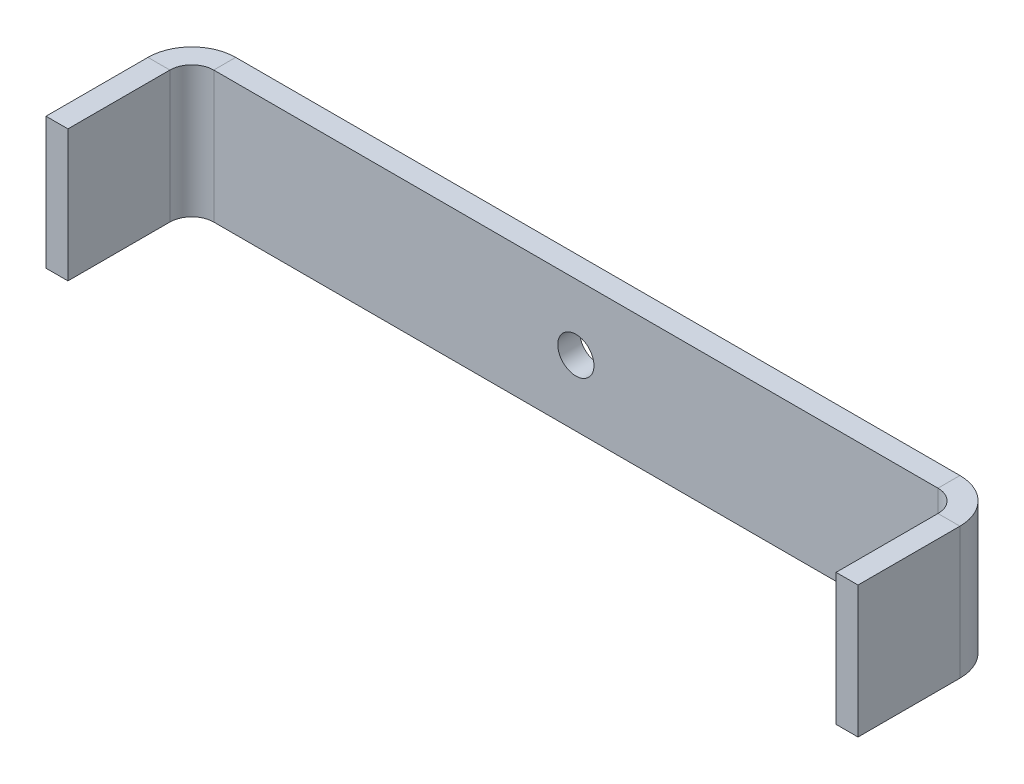
ISO-10303-21;
HEADER;
FILE_DESCRIPTION(('STEP AP214'),'2;1');
FILE_NAME('part.step','',(''),(''),'','','');
FILE_SCHEMA(('AUTOMOTIVE_DESIGN { 1 0 10303 214 1 1 1 1 }'));
ENDSEC;
DATA;
#1=APPLICATION_CONTEXT('core data for automotive mechanical design processes');
#2=APPLICATION_PROTOCOL_DEFINITION('international standard','automotive_design',2000,#1);
#3=PRODUCT_CONTEXT('',#1,'mechanical');
#4=PRODUCT('Part','Part','',(#3));
#5=PRODUCT_RELATED_PRODUCT_CATEGORY('part','',(#4));
#6=PRODUCT_DEFINITION_FORMATION('','',#4);
#7=PRODUCT_DEFINITION_CONTEXT('part definition',#1,'design');
#8=PRODUCT_DEFINITION('design','',#6,#7);
#9=PRODUCT_DEFINITION_SHAPE('','',#8);
#10=(LENGTH_UNIT() NAMED_UNIT(*) SI_UNIT(.MILLI.,.METRE.));
#11=(NAMED_UNIT(*) PLANE_ANGLE_UNIT() SI_UNIT($,.RADIAN.));
#12=(NAMED_UNIT(*) SI_UNIT($,.STERADIAN.) SOLID_ANGLE_UNIT());
#13=UNCERTAINTY_MEASURE_WITH_UNIT(LENGTH_MEASURE(1.E-05),#10,'distance_accuracy_value','');
#14=(GEOMETRIC_REPRESENTATION_CONTEXT(3) GLOBAL_UNCERTAINTY_ASSIGNED_CONTEXT((#13)) GLOBAL_UNIT_ASSIGNED_CONTEXT((#10,
#11,#12)) REPRESENTATION_CONTEXT('',''));
#15=CARTESIAN_POINT('',(0.,0.,0.));
#16=DIRECTION('',(0.,0.,1.));
#17=DIRECTION('',(1.,0.,0.));
#18=AXIS2_PLACEMENT_3D('',#15,#16,#17);
#19=CARTESIAN_POINT('',(0.,0.,0.));
#20=DIRECTION('',(0.,0.,1.));
#21=DIRECTION('',(1.,0.,0.));
#22=AXIS2_PLACEMENT_3D('',#19,#20,#21);
#23=PLANE('',#22);
#24=CARTESIAN_POINT('',(0.,0.,0.));
#25=DIRECTION('',(0.,0.,1.));
#26=DIRECTION('',(1.,0.,0.));
#27=AXIS2_PLACEMENT_3D('',#24,#25,#26);
#28=CIRCLE('',#27,1.65);
#29=CARTESIAN_POINT('',(1.65,0.,0.));
#30=VERTEX_POINT('',#29);
#31=EDGE_CURVE('E173',#30,#30,#28,.T.);
#32=ORIENTED_EDGE('',*,*,#31,.F.);
#33=EDGE_LOOP('',(#32));
#34=FACE_BOUND('',#33,.T.);
#35=DIRECTION('',(1.,0.,0.));
#36=VECTOR('',#35,1.);
#37=CARTESIAN_POINT('',(-47.,-6.,0.));
#38=LINE('',#37,#36);
#39=CARTESIAN_POINT('',(-33.,-6.,0.));
#40=VERTEX_POINT('',#39);
#41=CARTESIAN_POINT('',(33.,-6.,0.));
#42=VERTEX_POINT('',#41);
#43=EDGE_CURVE('E247',#40,#42,#38,.T.);
#44=ORIENTED_EDGE('',*,*,#43,.T.);
#45=DIRECTION('',(0.,1.,0.));
#46=VECTOR('',#45,1.);
#47=CARTESIAN_POINT('',(33.,0.,0.));
#48=LINE('',#47,#46);
#49=CARTESIAN_POINT('',(33.,6.,0.));
#50=VERTEX_POINT('',#49);
#51=EDGE_CURVE('E53',#42,#50,#48,.T.);
#52=ORIENTED_EDGE('',*,*,#51,.T.);
#53=DIRECTION('',(-1.,0.,0.));
#54=VECTOR('',#53,1.);
#55=CARTESIAN_POINT('',(-47.,6.,0.));
#56=LINE('',#55,#54);
#57=CARTESIAN_POINT('',(-33.,6.,0.));
#58=VERTEX_POINT('',#57);
#59=EDGE_CURVE('E69',#50,#58,#56,.T.);
#60=ORIENTED_EDGE('',*,*,#59,.T.);
#61=DIRECTION('',(0.,1.,0.));
#62=VECTOR('',#61,1.);
#63=CARTESIAN_POINT('',(-33.,0.,0.));
#64=LINE('',#63,#62);
#65=EDGE_CURVE('E233',#40,#58,#64,.T.);
#66=ORIENTED_EDGE('',*,*,#65,.F.);
#67=EDGE_LOOP('',(#44,#52,#60,#66));
#68=FACE_BOUND('',#67,.T.);
#69=ADVANCED_FACE('F44',(#34,#68),#23,.T.);
#70=CARTESIAN_POINT('',(-47.,6.,-2.));
#71=DIRECTION('',(0.,1.,0.));
#72=DIRECTION('',(0.,0.,1.));
#73=AXIS2_PLACEMENT_3D('',#70,#71,#72);
#74=PLANE('',#73);
#75=ORIENTED_EDGE('',*,*,#59,.F.);
#76=DIRECTION('',(0.,0.,-1.));
#77=VECTOR('',#76,1.);
#78=CARTESIAN_POINT('',(33.,6.,-2.));
#79=LINE('',#78,#77);
#80=CARTESIAN_POINT('',(33.,6.,-2.));
#81=VERTEX_POINT('',#80);
#82=EDGE_CURVE('E241',#50,#81,#79,.T.);
#83=ORIENTED_EDGE('',*,*,#82,.T.);
#84=DIRECTION('',(-1.,0.,0.));
#85=VECTOR('',#84,1.);
#86=CARTESIAN_POINT('',(-47.,6.,-2.));
#87=LINE('',#86,#85);
#88=CARTESIAN_POINT('',(-33.,6.,-2.));
#89=VERTEX_POINT('',#88);
#90=EDGE_CURVE('E48',#81,#89,#87,.T.);
#91=ORIENTED_EDGE('',*,*,#90,.T.);
#92=DIRECTION('',(0.,0.,-1.));
#93=VECTOR('',#92,1.);
#94=CARTESIAN_POINT('',(-33.,6.,-2.));
#95=LINE('',#94,#93);
#96=EDGE_CURVE('E236',#58,#89,#95,.T.);
#97=ORIENTED_EDGE('',*,*,#96,.F.);
#98=EDGE_LOOP('',(#75,#83,#91,#97));
#99=FACE_BOUND('',#98,.T.);
#100=ADVANCED_FACE('F252',(#99),#74,.T.);
#101=CARTESIAN_POINT('',(-47.,-6.,-2.));
#102=DIRECTION('',(0.,-1.,0.));
#103=DIRECTION('',(0.,0.,-1.));
#104=AXIS2_PLACEMENT_3D('',#101,#102,#103);
#105=PLANE('',#104);
#106=DIRECTION('',(1.,0.,0.));
#107=VECTOR('',#106,1.);
#108=CARTESIAN_POINT('',(-47.,-6.,-2.));
#109=LINE('',#108,#107);
#110=CARTESIAN_POINT('',(-33.,-6.,-2.));
#111=VERTEX_POINT('',#110);
#112=CARTESIAN_POINT('',(33.,-6.,-2.));
#113=VERTEX_POINT('',#112);
#114=EDGE_CURVE('E230',#111,#113,#109,.T.);
#115=ORIENTED_EDGE('',*,*,#114,.T.);
#116=DIRECTION('',(0.,0.,1.));
#117=VECTOR('',#116,1.);
#118=CARTESIAN_POINT('',(33.,-6.,-2.));
#119=LINE('',#118,#117);
#120=EDGE_CURVE('E12',#113,#42,#119,.T.);
#121=ORIENTED_EDGE('',*,*,#120,.T.);
#122=ORIENTED_EDGE('',*,*,#43,.F.);
#123=DIRECTION('',(0.,0.,1.));
#124=VECTOR('',#123,1.);
#125=CARTESIAN_POINT('',(-33.,-6.,-2.));
#126=LINE('',#125,#124);
#127=EDGE_CURVE('E229',#111,#40,#126,.T.);
#128=ORIENTED_EDGE('',*,*,#127,.F.);
#129=EDGE_LOOP('',(#115,#121,#122,#128));
#130=FACE_BOUND('',#129,.T.);
#131=ADVANCED_FACE('F46',(#130),#105,.T.);
#132=CARTESIAN_POINT('',(0.,0.,-2.));
#133=DIRECTION('',(0.,0.,1.));
#134=DIRECTION('',(1.,0.,0.));
#135=AXIS2_PLACEMENT_3D('',#132,#133,#134);
#136=PLANE('',#135);
#137=CARTESIAN_POINT('',(0.,0.,-2.));
#138=DIRECTION('',(0.,0.,-1.));
#139=DIRECTION('',(-1.,0.,0.));
#140=AXIS2_PLACEMENT_3D('',#137,#138,#139);
#141=CIRCLE('',#140,1.65);
#142=CARTESIAN_POINT('',(-1.65,0.,-2.));
#143=VERTEX_POINT('',#142);
#144=EDGE_CURVE('E546',#143,#143,#141,.T.);
#145=ORIENTED_EDGE('',*,*,#144,.F.);
#146=EDGE_LOOP('',(#145));
#147=FACE_BOUND('',#146,.T.);
#148=DIRECTION('',(0.,1.,0.));
#149=VECTOR('',#148,1.);
#150=CARTESIAN_POINT('',(33.,0.,-2.));
#151=LINE('',#150,#149);
#152=EDGE_CURVE('E239',#113,#81,#151,.T.);
#153=ORIENTED_EDGE('',*,*,#152,.F.);
#154=ORIENTED_EDGE('',*,*,#114,.F.);
#155=DIRECTION('',(0.,1.,0.));
#156=VECTOR('',#155,1.);
#157=CARTESIAN_POINT('',(-33.,0.,-2.));
#158=LINE('',#157,#156);
#159=EDGE_CURVE('E227',#111,#89,#158,.T.);
#160=ORIENTED_EDGE('',*,*,#159,.T.);
#161=ORIENTED_EDGE('',*,*,#90,.F.);
#162=EDGE_LOOP('',(#153,#154,#160,#161));
#163=FACE_BOUND('',#162,.T.);
#164=ADVANCED_FACE('F305',(#147,#163),#136,.F.);
#165=CARTESIAN_POINT('',(-33.,-6.,2.));
#166=DIRECTION('',(0.,-1.,0.));
#167=DIRECTION('',(0.,0.,-1.));
#168=AXIS2_PLACEMENT_3D('',#165,#166,#167);
#169=PLANE('',#168);
#170=ORIENTED_EDGE('',*,*,#127,.T.);
#171=CARTESIAN_POINT('',(-33.,-6.,2.));
#172=DIRECTION('',(0.,1.,0.));
#173=DIRECTION('',(0.,0.,1.));
#174=AXIS2_PLACEMENT_3D('',#171,#172,#173);
#175=CIRCLE('',#174,2.);
#176=CARTESIAN_POINT('',(-35.,-6.,2.00000000000001));
#177=VERTEX_POINT('',#176);
#178=EDGE_CURVE('E188',#40,#177,#175,.T.);
#179=ORIENTED_EDGE('',*,*,#178,.T.);
#180=DIRECTION('',(1.,0.,0.));
#181=VECTOR('',#180,1.);
#182=CARTESIAN_POINT('',(-37.,-6.,2.00000000000002));
#183=LINE('',#182,#181);
#184=CARTESIAN_POINT('',(-37.,-6.,2.00000000000002));
#185=VERTEX_POINT('',#184);
#186=EDGE_CURVE('E203',#185,#177,#183,.T.);
#187=ORIENTED_EDGE('',*,*,#186,.F.);
#188=CARTESIAN_POINT('',(-33.,-6.,2.));
#189=DIRECTION('',(0.,1.,0.));
#190=DIRECTION('',(0.,0.,-1.));
#191=AXIS2_PLACEMENT_3D('',#188,#189,#190);
#192=CIRCLE('',#191,4.);
#193=EDGE_CURVE('E216',#111,#185,#192,.T.);
#194=ORIENTED_EDGE('',*,*,#193,.F.);
#195=EDGE_LOOP('',(#170,#179,#187,#194));
#196=FACE_BOUND('',#195,.T.);
#197=ADVANCED_FACE('F275',(#196),#169,.T.);
#198=CARTESIAN_POINT('',(-33.,6.,2.));
#199=DIRECTION('',(0.,1.,0.));
#200=DIRECTION('',(0.,0.,1.));
#201=AXIS2_PLACEMENT_3D('',#198,#199,#200);
#202=PLANE('',#201);
#203=DIRECTION('',(-1.,0.,0.));
#204=VECTOR('',#203,1.);
#205=CARTESIAN_POINT('',(-37.,6.,2.00000000000002));
#206=LINE('',#205,#204);
#207=CARTESIAN_POINT('',(-35.,6.,2.00000000000001));
#208=VERTEX_POINT('',#207);
#209=CARTESIAN_POINT('',(-37.,6.,2.00000000000002));
#210=VERTEX_POINT('',#209);
#211=EDGE_CURVE('E191',#208,#210,#206,.T.);
#212=ORIENTED_EDGE('',*,*,#211,.F.);
#213=CARTESIAN_POINT('',(-33.,6.,2.));
#214=DIRECTION('',(0.,1.,0.));
#215=DIRECTION('',(0.,0.,1.));
#216=AXIS2_PLACEMENT_3D('',#213,#214,#215);
#217=CIRCLE('',#216,2.);
#218=EDGE_CURVE('E220',#208,#58,#217,.F.);
#219=ORIENTED_EDGE('',*,*,#218,.T.);
#220=ORIENTED_EDGE('',*,*,#96,.T.);
#221=CARTESIAN_POINT('',(-33.,6.,2.));
#222=DIRECTION('',(0.,-1.,0.));
#223=DIRECTION('',(0.,0.,1.));
#224=AXIS2_PLACEMENT_3D('',#221,#222,#223);
#225=CIRCLE('',#224,4.);
#226=EDGE_CURVE('E219',#210,#89,#225,.T.);
#227=ORIENTED_EDGE('',*,*,#226,.F.);
#228=EDGE_LOOP('',(#212,#219,#220,#227));
#229=FACE_BOUND('',#228,.T.);
#230=ADVANCED_FACE('F258',(#229),#202,.T.);
#231=CARTESIAN_POINT('',(-33.,-13.0463255325954,2.));
#232=DIRECTION('',(0.,1.,0.));
#233=DIRECTION('',(0.,0.,1.));
#234=AXIS2_PLACEMENT_3D('',#231,#232,#233);
#235=CYLINDRICAL_SURFACE('',#234,4.);
#236=ORIENTED_EDGE('',*,*,#226,.T.);
#237=ORIENTED_EDGE('',*,*,#159,.F.);
#238=ORIENTED_EDGE('',*,*,#193,.T.);
#239=DIRECTION('',(0.,1.,0.));
#240=VECTOR('',#239,1.);
#241=CARTESIAN_POINT('',(-37.,0.,2.00000000000002));
#242=LINE('',#241,#240);
#243=EDGE_CURVE('E181',#185,#210,#242,.T.);
#244=ORIENTED_EDGE('',*,*,#243,.T.);
#245=EDGE_LOOP('',(#236,#237,#238,#244));
#246=FACE_BOUND('',#245,.T.);
#247=ADVANCED_FACE('F262',(#246),#235,.T.);
#248=CARTESIAN_POINT('',(-33.,-13.0463255325954,2.));
#249=DIRECTION('',(0.,1.,0.));
#250=DIRECTION('',(0.,0.,1.));
#251=AXIS2_PLACEMENT_3D('',#248,#249,#250);
#252=CYLINDRICAL_SURFACE('',#251,2.);
#253=ORIENTED_EDGE('',*,*,#218,.F.);
#254=DIRECTION('',(0.,1.,0.));
#255=VECTOR('',#254,1.);
#256=CARTESIAN_POINT('',(-35.,0.,2.00000000000001));
#257=LINE('',#256,#255);
#258=EDGE_CURVE('E198',#177,#208,#257,.T.);
#259=ORIENTED_EDGE('',*,*,#258,.F.);
#260=ORIENTED_EDGE('',*,*,#178,.F.);
#261=ORIENTED_EDGE('',*,*,#65,.T.);
#262=EDGE_LOOP('',(#253,#259,#260,#261));
#263=FACE_BOUND('',#262,.T.);
#264=ADVANCED_FACE('F279',(#263),#252,.F.);
#265=CARTESIAN_POINT('',(-37.,6.,11.2876110196153));
#266=DIRECTION('',(0.,0.,1.));
#267=DIRECTION('',(1.,0.,0.));
#268=AXIS2_PLACEMENT_3D('',#265,#266,#267);
#269=PLANE('',#268);
#270=DIRECTION('',(0.,-1.,0.));
#271=VECTOR('',#270,1.);
#272=CARTESIAN_POINT('',(-35.,6.,11.2876110196153));
#273=LINE('',#272,#271);
#274=CARTESIAN_POINT('',(-35.,6.,11.2876110196153));
#275=VERTEX_POINT('',#274);
#276=CARTESIAN_POINT('',(-35.,-6.,11.2876110196153));
#277=VERTEX_POINT('',#276);
#278=EDGE_CURVE('E193',#275,#277,#273,.T.);
#279=ORIENTED_EDGE('',*,*,#278,.F.);
#280=DIRECTION('',(1.,0.,0.));
#281=VECTOR('',#280,1.);
#282=CARTESIAN_POINT('',(-37.,6.,11.2876110196153));
#283=LINE('',#282,#281);
#284=CARTESIAN_POINT('',(-37.,6.,11.2876110196153));
#285=VERTEX_POINT('',#284);
#286=EDGE_CURVE('E185',#285,#275,#283,.T.);
#287=ORIENTED_EDGE('',*,*,#286,.F.);
#288=DIRECTION('',(0.,-1.,0.));
#289=VECTOR('',#288,1.);
#290=CARTESIAN_POINT('',(-37.,6.,11.2876110196153));
#291=LINE('',#290,#289);
#292=CARTESIAN_POINT('',(-37.,-6.,11.2876110196153));
#293=VERTEX_POINT('',#292);
#294=EDGE_CURVE('E211',#285,#293,#291,.T.);
#295=ORIENTED_EDGE('',*,*,#294,.T.);
#296=DIRECTION('',(1.,0.,0.));
#297=VECTOR('',#296,1.);
#298=CARTESIAN_POINT('',(-37.,-6.,11.2876110196153));
#299=LINE('',#298,#297);
#300=EDGE_CURVE('E209',#293,#277,#299,.T.);
#301=ORIENTED_EDGE('',*,*,#300,.T.);
#302=EDGE_LOOP('',(#279,#287,#295,#301));
#303=FACE_BOUND('',#302,.T.);
#304=ADVANCED_FACE('F287',(#303),#269,.T.);
#305=CARTESIAN_POINT('',(-37.0000000000001,0.,-35.7123889803847));
#306=DIRECTION('',(1.,0.,0.));
#307=DIRECTION('',(0.,0.,-1.));
#308=AXIS2_PLACEMENT_3D('',#305,#306,#307);
#309=PLANE('',#308);
#310=ORIENTED_EDGE('',*,*,#243,.F.);
#311=DIRECTION('',(0.,0.,-1.));
#312=VECTOR('',#311,1.);
#313=CARTESIAN_POINT('',(-37.,-6.,11.2876110196153));
#314=LINE('',#313,#312);
#315=EDGE_CURVE('E206',#293,#185,#314,.T.);
#316=ORIENTED_EDGE('',*,*,#315,.F.);
#317=ORIENTED_EDGE('',*,*,#294,.F.);
#318=DIRECTION('',(0.,0.,1.));
#319=VECTOR('',#318,1.);
#320=CARTESIAN_POINT('',(-37.,6.,11.2876110196153));
#321=LINE('',#320,#319);
#322=EDGE_CURVE('E189',#210,#285,#321,.T.);
#323=ORIENTED_EDGE('',*,*,#322,.F.);
#324=EDGE_LOOP('',(#310,#316,#317,#323));
#325=FACE_BOUND('',#324,.T.);
#326=ADVANCED_FACE('F267',(#325),#309,.F.);
#327=CARTESIAN_POINT('',(-37.,-6.,11.2876110196153));
#328=DIRECTION('',(0.,-1.,0.));
#329=DIRECTION('',(-1.,0.,0.));
#330=AXIS2_PLACEMENT_3D('',#327,#328,#329);
#331=PLANE('',#330);
#332=ORIENTED_EDGE('',*,*,#315,.T.);
#333=ORIENTED_EDGE('',*,*,#186,.T.);
#334=DIRECTION('',(0.,0.,-1.));
#335=VECTOR('',#334,1.);
#336=CARTESIAN_POINT('',(-35.,-6.,11.2876110196153));
#337=LINE('',#336,#335);
#338=EDGE_CURVE('E201',#277,#177,#337,.T.);
#339=ORIENTED_EDGE('',*,*,#338,.F.);
#340=ORIENTED_EDGE('',*,*,#300,.F.);
#341=EDGE_LOOP('',(#332,#333,#339,#340));
#342=FACE_BOUND('',#341,.T.);
#343=ADVANCED_FACE('F271',(#342),#331,.T.);
#344=CARTESIAN_POINT('',(-35.0000000000001,0.,-35.7123889803847));
#345=DIRECTION('',(1.,0.,0.));
#346=DIRECTION('',(0.,0.,-1.));
#347=AXIS2_PLACEMENT_3D('',#344,#345,#346);
#348=PLANE('',#347);
#349=ORIENTED_EDGE('',*,*,#338,.T.);
#350=ORIENTED_EDGE('',*,*,#258,.T.);
#351=DIRECTION('',(0.,0.,1.));
#352=VECTOR('',#351,1.);
#353=CARTESIAN_POINT('',(-35.,6.,11.2876110196153));
#354=LINE('',#353,#352);
#355=EDGE_CURVE('E196',#208,#275,#354,.T.);
#356=ORIENTED_EDGE('',*,*,#355,.T.);
#357=ORIENTED_EDGE('',*,*,#278,.T.);
#358=EDGE_LOOP('',(#349,#350,#356,#357));
#359=FACE_BOUND('',#358,.T.);
#360=ADVANCED_FACE('F281',(#359),#348,.T.);
#361=CARTESIAN_POINT('',(-37.,6.,11.2876110196153));
#362=DIRECTION('',(0.,1.,0.));
#363=DIRECTION('',(1.,0.,0.));
#364=AXIS2_PLACEMENT_3D('',#361,#362,#363);
#365=PLANE('',#364);
#366=ORIENTED_EDGE('',*,*,#355,.F.);
#367=ORIENTED_EDGE('',*,*,#211,.T.);
#368=ORIENTED_EDGE('',*,*,#322,.T.);
#369=ORIENTED_EDGE('',*,*,#286,.T.);
#370=EDGE_LOOP('',(#366,#367,#368,#369));
#371=FACE_BOUND('',#370,.T.);
#372=ADVANCED_FACE('F283',(#371),#365,.T.);
#373=CARTESIAN_POINT('',(33.,-6.,2.));
#374=DIRECTION('',(0.,-1.,0.));
#375=DIRECTION('',(0.,0.,-1.));
#376=AXIS2_PLACEMENT_3D('',#373,#374,#375);
#377=PLANE('',#376);
#378=DIRECTION('',(-1.,0.,0.));
#379=VECTOR('',#378,1.);
#380=CARTESIAN_POINT('',(37.,-6.,2.00000000000002));
#381=LINE('',#380,#379);
#382=CARTESIAN_POINT('',(37.,-6.,2.00000000000002));
#383=VERTEX_POINT('',#382);
#384=CARTESIAN_POINT('',(35.,-6.,2.00000000000001));
#385=VERTEX_POINT('',#384);
#386=EDGE_CURVE('E143',#383,#385,#381,.T.);
#387=ORIENTED_EDGE('',*,*,#386,.T.);
#388=CARTESIAN_POINT('',(33.,-6.,2.));
#389=DIRECTION('',(0.,-1.,0.));
#390=DIRECTION('',(0.,0.,-1.));
#391=AXIS2_PLACEMENT_3D('',#388,#389,#390);
#392=CIRCLE('',#391,2.);
#393=EDGE_CURVE('E61',#385,#42,#392,.F.);
#394=ORIENTED_EDGE('',*,*,#393,.T.);
#395=ORIENTED_EDGE('',*,*,#120,.F.);
#396=CARTESIAN_POINT('',(33.,-6.,2.));
#397=DIRECTION('',(0.,1.,0.));
#398=DIRECTION('',(0.,0.,-1.));
#399=AXIS2_PLACEMENT_3D('',#396,#397,#398);
#400=CIRCLE('',#399,4.);
#401=EDGE_CURVE('E174',#383,#113,#400,.T.);
#402=ORIENTED_EDGE('',*,*,#401,.F.);
#403=EDGE_LOOP('',(#387,#394,#395,#402));
#404=FACE_BOUND('',#403,.T.);
#405=ADVANCED_FACE('F317',(#404),#377,.T.);
#406=CARTESIAN_POINT('',(33.,6.,2.));
#407=DIRECTION('',(0.,1.,0.));
#408=DIRECTION('',(0.,0.,1.));
#409=AXIS2_PLACEMENT_3D('',#406,#407,#408);
#410=PLANE('',#409);
#411=CARTESIAN_POINT('',(33.,6.,2.));
#412=DIRECTION('',(0.,-1.,0.));
#413=DIRECTION('',(0.,0.,-1.));
#414=AXIS2_PLACEMENT_3D('',#411,#412,#413);
#415=CIRCLE('',#414,2.);
#416=CARTESIAN_POINT('',(35.,6.,2.00000000000001));
#417=VERTEX_POINT('',#416);
#418=EDGE_CURVE('E178',#50,#417,#415,.T.);
#419=ORIENTED_EDGE('',*,*,#418,.T.);
#420=DIRECTION('',(1.,0.,0.));
#421=VECTOR('',#420,1.);
#422=CARTESIAN_POINT('',(37.,6.,2.00000000000002));
#423=LINE('',#422,#421);
#424=CARTESIAN_POINT('',(37.,6.,2.00000000000002));
#425=VERTEX_POINT('',#424);
#426=EDGE_CURVE('E161',#417,#425,#423,.T.);
#427=ORIENTED_EDGE('',*,*,#426,.T.);
#428=CARTESIAN_POINT('',(33.,6.,2.));
#429=DIRECTION('',(0.,-1.,0.));
#430=DIRECTION('',(0.,0.,1.));
#431=AXIS2_PLACEMENT_3D('',#428,#429,#430);
#432=CIRCLE('',#431,4.);
#433=EDGE_CURVE('E177',#81,#425,#432,.T.);
#434=ORIENTED_EDGE('',*,*,#433,.F.);
#435=ORIENTED_EDGE('',*,*,#82,.F.);
#436=EDGE_LOOP('',(#419,#427,#434,#435));
#437=FACE_BOUND('',#436,.T.);
#438=ADVANCED_FACE('F339',(#437),#410,.T.);
#439=CARTESIAN_POINT('',(33.,13.0463255325954,2.));
#440=DIRECTION('',(0.,-1.,0.));
#441=DIRECTION('',(0.,0.,-1.));
#442=AXIS2_PLACEMENT_3D('',#439,#440,#441);
#443=CYLINDRICAL_SURFACE('',#442,4.);
#444=ORIENTED_EDGE('',*,*,#152,.T.);
#445=ORIENTED_EDGE('',*,*,#433,.T.);
#446=DIRECTION('',(0.,1.,0.));
#447=VECTOR('',#446,1.);
#448=CARTESIAN_POINT('',(37.,0.,2.00000000000001));
#449=LINE('',#448,#447);
#450=EDGE_CURVE('E163',#383,#425,#449,.T.);
#451=ORIENTED_EDGE('',*,*,#450,.F.);
#452=ORIENTED_EDGE('',*,*,#401,.T.);
#453=EDGE_LOOP('',(#444,#445,#451,#452));
#454=FACE_BOUND('',#453,.T.);
#455=ADVANCED_FACE('F346',(#454),#443,.T.);
#456=CARTESIAN_POINT('',(33.,13.0463255325954,2.));
#457=DIRECTION('',(0.,-1.,0.));
#458=DIRECTION('',(0.,0.,-1.));
#459=AXIS2_PLACEMENT_3D('',#456,#457,#458);
#460=CYLINDRICAL_SURFACE('',#459,2.);
#461=ORIENTED_EDGE('',*,*,#51,.F.);
#462=ORIENTED_EDGE('',*,*,#393,.F.);
#463=DIRECTION('',(0.,1.,0.));
#464=VECTOR('',#463,1.);
#465=CARTESIAN_POINT('',(35.,0.,2.));
#466=LINE('',#465,#464);
#467=EDGE_CURVE('E166',#385,#417,#466,.T.);
#468=ORIENTED_EDGE('',*,*,#467,.T.);
#469=ORIENTED_EDGE('',*,*,#418,.F.);
#470=EDGE_LOOP('',(#461,#462,#468,#469));
#471=FACE_BOUND('',#470,.T.);
#472=ADVANCED_FACE('F353',(#471),#460,.F.);
#473=CARTESIAN_POINT('',(37.,6.,11.2876110196153));
#474=DIRECTION('',(0.,0.,1.));
#475=DIRECTION('',(1.,0.,0.));
#476=AXIS2_PLACEMENT_3D('',#473,#474,#475);
#477=PLANE('',#476);
#478=DIRECTION('',(0.,1.,0.));
#479=VECTOR('',#478,1.);
#480=CARTESIAN_POINT('',(35.,6.,11.2876110196153));
#481=LINE('',#480,#479);
#482=CARTESIAN_POINT('',(35.,-6.,11.2876110196153));
#483=VERTEX_POINT('',#482);
#484=CARTESIAN_POINT('',(35.,6.,11.2876110196153));
#485=VERTEX_POINT('',#484);
#486=EDGE_CURVE('E154',#483,#485,#481,.T.);
#487=ORIENTED_EDGE('',*,*,#486,.F.);
#488=DIRECTION('',(-1.,0.,0.));
#489=VECTOR('',#488,1.);
#490=CARTESIAN_POINT('',(37.,-6.,11.2876110196153));
#491=LINE('',#490,#489);
#492=CARTESIAN_POINT('',(37.,-6.,11.2876110196153));
#493=VERTEX_POINT('',#492);
#494=EDGE_CURVE('E141',#493,#483,#491,.T.);
#495=ORIENTED_EDGE('',*,*,#494,.F.);
#496=DIRECTION('',(0.,1.,0.));
#497=VECTOR('',#496,1.);
#498=CARTESIAN_POINT('',(37.,6.,11.2876110196153));
#499=LINE('',#498,#497);
#500=CARTESIAN_POINT('',(37.,6.,11.2876110196153));
#501=VERTEX_POINT('',#500);
#502=EDGE_CURVE('E152',#493,#501,#499,.T.);
#503=ORIENTED_EDGE('',*,*,#502,.T.);
#504=DIRECTION('',(-1.,0.,0.));
#505=VECTOR('',#504,1.);
#506=CARTESIAN_POINT('',(37.,6.,11.2876110196153));
#507=LINE('',#506,#505);
#508=EDGE_CURVE('E160',#501,#485,#507,.T.);
#509=ORIENTED_EDGE('',*,*,#508,.T.);
#510=EDGE_LOOP('',(#487,#495,#503,#509));
#511=FACE_BOUND('',#510,.T.);
#512=ADVANCED_FACE('F151',(#511),#477,.T.);
#513=CARTESIAN_POINT('',(37.0000000000001,0.,-35.7123889803847));
#514=DIRECTION('',(-1.,0.,0.));
#515=DIRECTION('',(0.,0.,1.));
#516=AXIS2_PLACEMENT_3D('',#513,#514,#515);
#517=PLANE('',#516);
#518=DIRECTION('',(0.,0.,1.));
#519=VECTOR('',#518,1.);
#520=CARTESIAN_POINT('',(37.0000000000003,-6.,-82.7123889803847));
#521=LINE('',#520,#519);
#522=EDGE_CURVE('E138',#383,#493,#521,.T.);
#523=ORIENTED_EDGE('',*,*,#522,.F.);
#524=ORIENTED_EDGE('',*,*,#450,.T.);
#525=DIRECTION('',(0.,0.,-1.));
#526=VECTOR('',#525,1.);
#527=CARTESIAN_POINT('',(37.0000000000003,6.,-82.7123889803847));
#528=LINE('',#527,#526);
#529=EDGE_CURVE('E159',#501,#425,#528,.T.);
#530=ORIENTED_EDGE('',*,*,#529,.F.);
#531=ORIENTED_EDGE('',*,*,#502,.F.);
#532=EDGE_LOOP('',(#523,#524,#530,#531));
#533=FACE_BOUND('',#532,.T.);
#534=ADVANCED_FACE('F157',(#533),#517,.F.);
#535=CARTESIAN_POINT('',(37.0000000000003,6.,-82.7123889803847));
#536=DIRECTION('',(0.,1.,0.));
#537=DIRECTION('',(-1.,0.,0.));
#538=AXIS2_PLACEMENT_3D('',#535,#536,#537);
#539=PLANE('',#538);
#540=ORIENTED_EDGE('',*,*,#426,.F.);
#541=DIRECTION('',(0.,0.,-1.));
#542=VECTOR('',#541,1.);
#543=CARTESIAN_POINT('',(35.0000000000003,6.,-82.7123889803847));
#544=LINE('',#543,#542);
#545=EDGE_CURVE('E147',#485,#417,#544,.T.);
#546=ORIENTED_EDGE('',*,*,#545,.F.);
#547=ORIENTED_EDGE('',*,*,#508,.F.);
#548=ORIENTED_EDGE('',*,*,#529,.T.);
#549=EDGE_LOOP('',(#540,#546,#547,#548));
#550=FACE_BOUND('',#549,.T.);
#551=ADVANCED_FACE('F374',(#550),#539,.T.);
#552=CARTESIAN_POINT('',(35.0000000000001,0.,-35.7123889803847));
#553=DIRECTION('',(-1.,0.,0.));
#554=DIRECTION('',(0.,0.,1.));
#555=AXIS2_PLACEMENT_3D('',#552,#553,#554);
#556=PLANE('',#555);
#557=ORIENTED_EDGE('',*,*,#467,.F.);
#558=DIRECTION('',(0.,0.,1.));
#559=VECTOR('',#558,1.);
#560=CARTESIAN_POINT('',(35.0000000000003,-6.,-82.7123889803847));
#561=LINE('',#560,#559);
#562=EDGE_CURVE('E538',#385,#483,#561,.T.);
#563=ORIENTED_EDGE('',*,*,#562,.T.);
#564=ORIENTED_EDGE('',*,*,#486,.T.);
#565=ORIENTED_EDGE('',*,*,#545,.T.);
#566=EDGE_LOOP('',(#557,#563,#564,#565));
#567=FACE_BOUND('',#566,.T.);
#568=ADVANCED_FACE('F381',(#567),#556,.T.);
#569=CARTESIAN_POINT('',(37.0000000000003,-6.,-82.7123889803847));
#570=DIRECTION('',(0.,-1.,0.));
#571=DIRECTION('',(1.,0.,0.));
#572=AXIS2_PLACEMENT_3D('',#569,#570,#571);
#573=PLANE('',#572);
#574=ORIENTED_EDGE('',*,*,#386,.F.);
#575=ORIENTED_EDGE('',*,*,#522,.T.);
#576=ORIENTED_EDGE('',*,*,#494,.T.);
#577=ORIENTED_EDGE('',*,*,#562,.F.);
#578=EDGE_LOOP('',(#574,#575,#576,#577));
#579=FACE_BOUND('',#578,.T.);
#580=ADVANCED_FACE('F140',(#579),#573,.T.);
#581=CARTESIAN_POINT('',(0.,0.,-2.));
#582=DIRECTION('',(0.,0.,-1.));
#583=DIRECTION('',(-1.,0.,0.));
#584=AXIS2_PLACEMENT_3D('',#581,#582,#583);
#585=CYLINDRICAL_SURFACE('',#584,1.65);
#586=ORIENTED_EDGE('',*,*,#31,.T.);
#587=EDGE_LOOP('',(#586));
#588=FACE_BOUND('',#587,.T.);
#589=ORIENTED_EDGE('',*,*,#144,.T.);
#590=EDGE_LOOP('',(#589));
#591=FACE_BOUND('',#590,.T.);
#592=ADVANCED_FACE('F396',(#588,#591),#585,.F.);
#593=CLOSED_SHELL('',(#69,#100,#131,#164,#197,#230,#247,#264,#304,#326,#343,#360,#372,#405,#438,
#455,#472,#512,#534,#551,#568,#580,#592));
#594=MANIFOLD_SOLID_BREP('B2',#593);
#595=ADVANCED_BREP_SHAPE_REPRESENTATION('',(#18,#594),#14);
#596=SHAPE_DEFINITION_REPRESENTATION(#9,#595);
ENDSEC;
END-ISO-10303-21;
